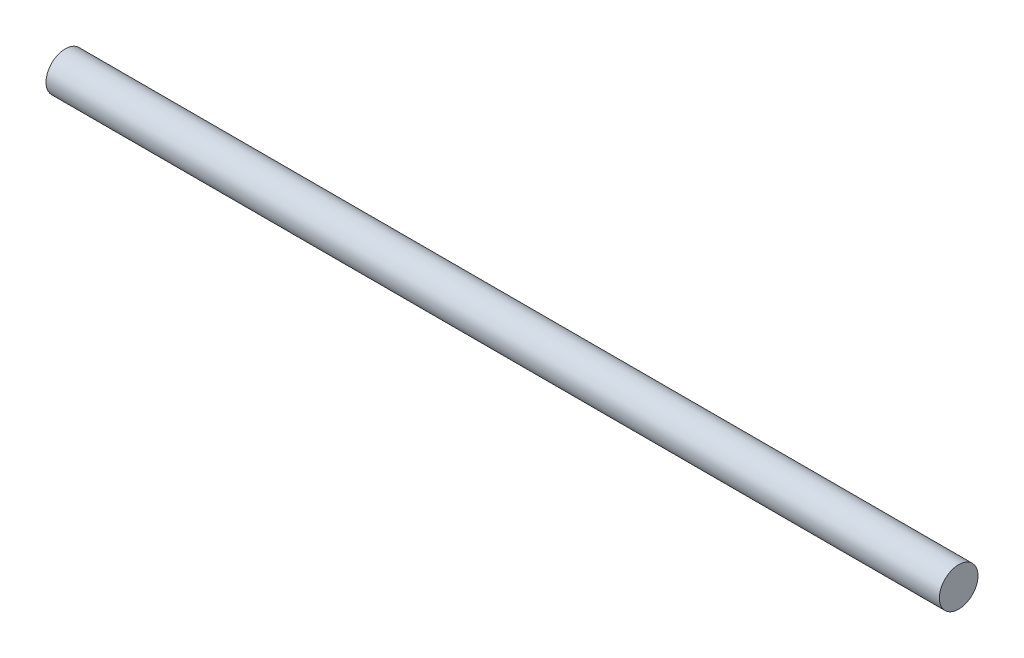
ISO-10303-21;
HEADER;
FILE_DESCRIPTION(('STEP AP214'),'2;1');
FILE_NAME('part.step','',(''),(''),'','','');
FILE_SCHEMA(('AUTOMOTIVE_DESIGN { 1 0 10303 214 1 1 1 1 }'));
ENDSEC;
DATA;
#1=APPLICATION_CONTEXT('core data for automotive mechanical design processes');
#2=APPLICATION_PROTOCOL_DEFINITION('international standard','automotive_design',2000,#1);
#3=PRODUCT_CONTEXT('',#1,'mechanical');
#4=PRODUCT('Part','Part','',(#3));
#5=PRODUCT_RELATED_PRODUCT_CATEGORY('part','',(#4));
#6=PRODUCT_DEFINITION_FORMATION('','',#4);
#7=PRODUCT_DEFINITION_CONTEXT('part definition',#1,'design');
#8=PRODUCT_DEFINITION('design','',#6,#7);
#9=PRODUCT_DEFINITION_SHAPE('','',#8);
#10=(LENGTH_UNIT() NAMED_UNIT(*) SI_UNIT(.MILLI.,.METRE.));
#11=(NAMED_UNIT(*) PLANE_ANGLE_UNIT() SI_UNIT($,.RADIAN.));
#12=(NAMED_UNIT(*) SI_UNIT($,.STERADIAN.) SOLID_ANGLE_UNIT());
#13=UNCERTAINTY_MEASURE_WITH_UNIT(LENGTH_MEASURE(1.E-05),#10,'distance_accuracy_value','');
#14=(GEOMETRIC_REPRESENTATION_CONTEXT(3) GLOBAL_UNCERTAINTY_ASSIGNED_CONTEXT((#13)) GLOBAL_UNIT_ASSIGNED_CONTEXT((#10,
#11,#12)) REPRESENTATION_CONTEXT('',''));
#15=CARTESIAN_POINT('',(0.,0.,0.));
#16=DIRECTION('',(0.,0.,1.));
#17=DIRECTION('',(1.,0.,0.));
#18=AXIS2_PLACEMENT_3D('',#15,#16,#17);
#19=CARTESIAN_POINT('',(48.7982815623901,-167.583767489058,21.2678193082412));
#20=DIRECTION('',(-1.,0.,0.));
#21=DIRECTION('',(0.,-1.,0.));
#22=AXIS2_PLACEMENT_3D('',#19,#20,#21);
#23=CYLINDRICAL_SURFACE('',#22,3.17500000000009);
#24=CARTESIAN_POINT('',(48.7982815623901,-167.583767489058,21.2678193082412));
#25=DIRECTION('',(1.,0.,0.));
#26=DIRECTION('',(0.,1.,0.));
#27=AXIS2_PLACEMENT_3D('',#24,#25,#26);
#28=CIRCLE('',#27,3.17500000000009);
#29=CARTESIAN_POINT('',(48.7982815623901,-164.408767489057,21.2678193082412));
#30=VERTEX_POINT('',#29);
#31=EDGE_CURVE('E11',#30,#30,#28,.T.);
#32=ORIENTED_EDGE('',*,*,#31,.F.);
#33=EDGE_LOOP('',(#32));
#34=FACE_BOUND('',#33,.T.);
#35=CARTESIAN_POINT('',(-98.01371843761,-167.583767489058,21.2678193082412));
#36=DIRECTION('',(1.,0.,0.));
#37=DIRECTION('',(0.,1.,0.));
#38=AXIS2_PLACEMENT_3D('',#35,#36,#37);
#39=CIRCLE('',#38,3.17500000000009);
#40=CARTESIAN_POINT('',(-98.01371843761,-164.408767489057,21.2678193082412));
#41=VERTEX_POINT('',#40);
#42=EDGE_CURVE('E48',#41,#41,#39,.T.);
#43=ORIENTED_EDGE('',*,*,#42,.T.);
#44=EDGE_LOOP('',(#43));
#45=FACE_BOUND('',#44,.T.);
#46=ADVANCED_FACE('F45',(#34,#45),#23,.T.);
#47=CARTESIAN_POINT('',(48.7982815623901,-167.583767489058,21.2678193082412));
#48=DIRECTION('',(1.,0.,0.));
#49=DIRECTION('',(0.,1.,0.));
#50=AXIS2_PLACEMENT_3D('',#47,#48,#49);
#51=PLANE('',#50);
#52=ORIENTED_EDGE('',*,*,#31,.T.);
#53=EDGE_LOOP('',(#52));
#54=FACE_BOUND('',#53,.T.);
#55=ADVANCED_FACE('F60',(#54),#51,.T.);
#56=CARTESIAN_POINT('',(-98.01371843761,-167.583767489058,21.2678193082412));
#57=DIRECTION('',(1.,0.,0.));
#58=DIRECTION('',(0.,1.,0.));
#59=AXIS2_PLACEMENT_3D('',#56,#57,#58);
#60=PLANE('',#59);
#61=ORIENTED_EDGE('',*,*,#42,.F.);
#62=EDGE_LOOP('',(#61));
#63=FACE_BOUND('',#62,.T.);
#64=ADVANCED_FACE('F58',(#63),#60,.F.);
#65=CLOSED_SHELL('',(#46,#55,#64));
#66=MANIFOLD_SOLID_BREP('B2',#65);
#67=ADVANCED_BREP_SHAPE_REPRESENTATION('',(#18,#66),#14);
#68=SHAPE_DEFINITION_REPRESENTATION(#9,#67);
ENDSEC;
END-ISO-10303-21;
